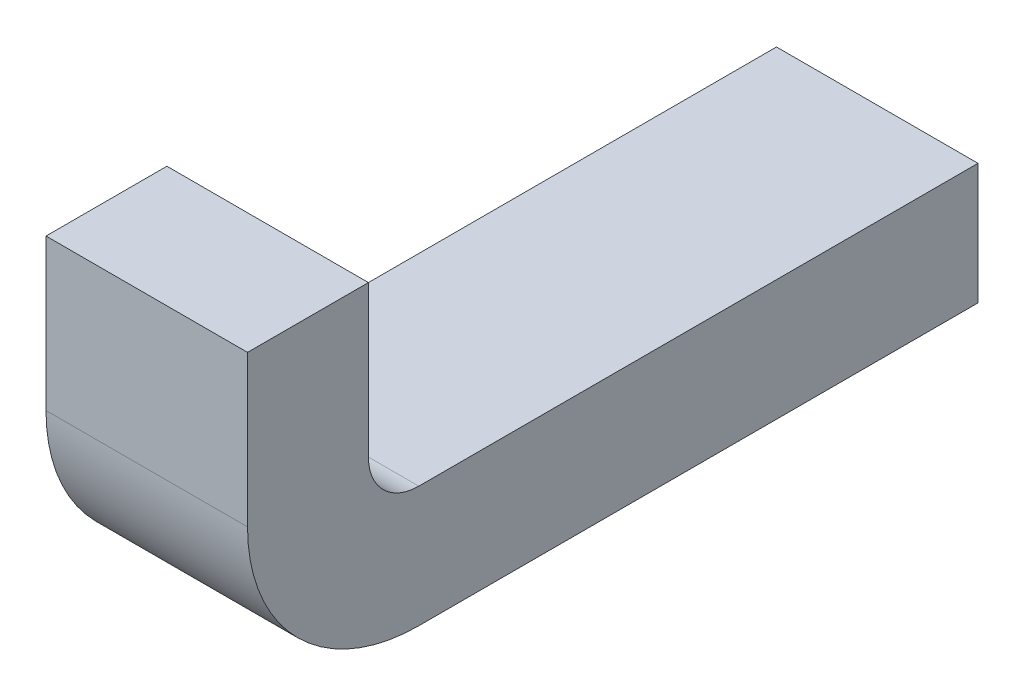
ISO-10303-21;
HEADER;
FILE_DESCRIPTION(('STEP AP214'),'2;1');
FILE_NAME('part.step','',(''),(''),'','','');
FILE_SCHEMA(('AUTOMOTIVE_DESIGN { 1 0 10303 214 1 1 1 1 }'));
ENDSEC;
DATA;
#1=APPLICATION_CONTEXT('core data for automotive mechanical design processes');
#2=APPLICATION_PROTOCOL_DEFINITION('international standard','automotive_design',2000,#1);
#3=PRODUCT_CONTEXT('',#1,'mechanical');
#4=PRODUCT('Part','Part','',(#3));
#5=PRODUCT_RELATED_PRODUCT_CATEGORY('part','',(#4));
#6=PRODUCT_DEFINITION_FORMATION('','',#4);
#7=PRODUCT_DEFINITION_CONTEXT('part definition',#1,'design');
#8=PRODUCT_DEFINITION('design','',#6,#7);
#9=PRODUCT_DEFINITION_SHAPE('','',#8);
#10=(LENGTH_UNIT() NAMED_UNIT(*) SI_UNIT(.MILLI.,.METRE.));
#11=(NAMED_UNIT(*) PLANE_ANGLE_UNIT() SI_UNIT($,.RADIAN.));
#12=(NAMED_UNIT(*) SI_UNIT($,.STERADIAN.) SOLID_ANGLE_UNIT());
#13=UNCERTAINTY_MEASURE_WITH_UNIT(LENGTH_MEASURE(1.E-05),#10,'distance_accuracy_value','');
#14=(GEOMETRIC_REPRESENTATION_CONTEXT(3) GLOBAL_UNCERTAINTY_ASSIGNED_CONTEXT((#13)) GLOBAL_UNIT_ASSIGNED_CONTEXT((#10,
#11,#12)) REPRESENTATION_CONTEXT('',''));
#15=CARTESIAN_POINT('',(0.,0.,0.));
#16=DIRECTION('',(0.,0.,1.));
#17=DIRECTION('',(1.,0.,0.));
#18=AXIS2_PLACEMENT_3D('',#15,#16,#17);
#19=CARTESIAN_POINT('',(-3.19,0.17,-3.250000000002));
#20=DIRECTION('',(0.,0.,-1.));
#21=DIRECTION('',(-1.,0.,0.));
#22=AXIS2_PLACEMENT_3D('',#19,#20,#21);
#23=PLANE('',#22);
#24=DIRECTION('',(0.,1.,0.));
#25=VECTOR('',#24,1.);
#26=CARTESIAN_POINT('',(-2.975,0.17,-3.250000000002));
#27=LINE('',#26,#25);
#28=CARTESIAN_POINT('',(-2.975,0.17,-3.250000000002));
#29=VERTEX_POINT('',#28);
#30=CARTESIAN_POINT('',(-2.975,0.32,-3.250000000002));
#31=VERTEX_POINT('',#30);
#32=EDGE_CURVE('E138',#29,#31,#27,.T.);
#33=ORIENTED_EDGE('',*,*,#32,.F.);
#34=DIRECTION('',(1.,0.,0.));
#35=VECTOR('',#34,1.);
#36=CARTESIAN_POINT('',(-3.19,0.17,-3.250000000002));
#37=LINE('',#36,#35);
#38=CARTESIAN_POINT('',(-3.175,0.17,-3.250000000002));
#39=VERTEX_POINT('',#38);
#40=EDGE_CURVE('E107',#29,#39,#37,.F.);
#41=ORIENTED_EDGE('',*,*,#40,.T.);
#42=DIRECTION('',(0.,1.,0.));
#43=VECTOR('',#42,1.);
#44=CARTESIAN_POINT('',(-3.175,0.32,-3.250000000002));
#45=LINE('',#44,#43);
#46=CARTESIAN_POINT('',(-3.175,0.32,-3.250000000002));
#47=VERTEX_POINT('',#46);
#48=EDGE_CURVE('E104',#39,#47,#45,.T.);
#49=ORIENTED_EDGE('',*,*,#48,.T.);
#50=DIRECTION('',(1.,0.,0.));
#51=VECTOR('',#50,1.);
#52=CARTESIAN_POINT('',(-3.19,0.32,-3.250000000002));
#53=LINE('',#52,#51);
#54=EDGE_CURVE('E131',#31,#47,#53,.F.);
#55=ORIENTED_EDGE('',*,*,#54,.F.);
#56=EDGE_LOOP('',(#33,#41,#49,#55));
#57=FACE_BOUND('',#56,.T.);
#58=ADVANCED_FACE('F16',(#57),#23,.T.);
#59=CARTESIAN_POINT('',(-3.19,0.32,-3.250000000002));
#60=DIRECTION('',(0.,1.,1.246832498358E-13));
#61=DIRECTION('',(0.,-1.246832498358E-13,1.));
#62=AXIS2_PLACEMENT_3D('',#59,#60,#61);
#63=PLANE('',#62);
#64=DIRECTION('',(0.,0.,-1.));
#65=VECTOR('',#64,1.);
#66=CARTESIAN_POINT('',(-2.975,0.32,-3.300000000002));
#67=LINE('',#66,#65);
#68=CARTESIAN_POINT('',(-2.975,0.32,-3.130000000002));
#69=VERTEX_POINT('',#68);
#70=EDGE_CURVE('E134',#31,#69,#67,.F.);
#71=ORIENTED_EDGE('',*,*,#70,.F.);
#72=ORIENTED_EDGE('',*,*,#54,.T.);
#73=DIRECTION('',(0.,0.,-1.));
#74=VECTOR('',#73,1.);
#75=CARTESIAN_POINT('',(-3.175,0.32,3.855));
#76=LINE('',#75,#74);
#77=CARTESIAN_POINT('',(-3.175,0.32,-3.130000000002));
#78=VERTEX_POINT('',#77);
#79=EDGE_CURVE('E98',#47,#78,#76,.F.);
#80=ORIENTED_EDGE('',*,*,#79,.T.);
#81=DIRECTION('',(1.,0.,0.));
#82=VECTOR('',#81,1.);
#83=CARTESIAN_POINT('',(-3.19,0.32,-3.130000000002));
#84=LINE('',#83,#82);
#85=EDGE_CURVE('E129',#69,#78,#84,.F.);
#86=ORIENTED_EDGE('',*,*,#85,.F.);
#87=EDGE_LOOP('',(#71,#72,#80,#86));
#88=FACE_BOUND('',#87,.T.);
#89=ADVANCED_FACE('F188',(#88),#63,.T.);
#90=CARTESIAN_POINT('',(-3.19,0.32,-3.130000000002));
#91=DIRECTION('',(0.,0.,1.));
#92=DIRECTION('',(1.,0.,0.));
#93=AXIS2_PLACEMENT_3D('',#90,#91,#92);
#94=PLANE('',#93);
#95=DIRECTION('',(0.,1.,0.));
#96=VECTOR('',#95,1.);
#97=CARTESIAN_POINT('',(-2.975,0.17,-3.130000000002));
#98=LINE('',#97,#96);
#99=CARTESIAN_POINT('',(-2.975,0.17,-3.130000000002));
#100=VERTEX_POINT('',#99);
#101=EDGE_CURVE('E137',#69,#100,#98,.F.);
#102=ORIENTED_EDGE('',*,*,#101,.F.);
#103=ORIENTED_EDGE('',*,*,#85,.T.);
#104=DIRECTION('',(0.,1.,0.));
#105=VECTOR('',#104,1.);
#106=CARTESIAN_POINT('',(-3.175,0.32,-3.130000000002));
#107=LINE('',#106,#105);
#108=CARTESIAN_POINT('',(-3.175,0.17,-3.130000000002));
#109=VERTEX_POINT('',#108);
#110=EDGE_CURVE('E78',#78,#109,#107,.F.);
#111=ORIENTED_EDGE('',*,*,#110,.T.);
#112=DIRECTION('',(1.,0.,0.));
#113=VECTOR('',#112,1.);
#114=CARTESIAN_POINT('',(-3.19,0.17,-3.130000000002));
#115=LINE('',#114,#113);
#116=EDGE_CURVE('E88',#100,#109,#115,.F.);
#117=ORIENTED_EDGE('',*,*,#116,.F.);
#118=EDGE_LOOP('',(#102,#103,#111,#117));
#119=FACE_BOUND('',#118,.T.);
#120=ADVANCED_FACE('F190',(#119),#94,.T.);
#121=CARTESIAN_POINT('',(-3.19,0.17,-3.300000000002));
#122=DIRECTION('',(1.,0.,0.));
#123=DIRECTION('',(0.,0.,-1.));
#124=AXIS2_PLACEMENT_3D('',#121,#122,#123);
#125=CYLINDRICAL_SURFACE('',#124,0.17);
#126=CARTESIAN_POINT('',(-2.975,0.17,-3.300000000002));
#127=DIRECTION('',(1.,0.,0.));
#128=DIRECTION('',(0.,0.,-1.));
#129=AXIS2_PLACEMENT_3D('',#126,#127,#128);
#130=CIRCLE('',#129,0.17);
#131=CARTESIAN_POINT('',(-2.975,0.,-3.300000000002));
#132=VERTEX_POINT('',#131);
#133=EDGE_CURVE('E149',#100,#132,#130,.T.);
#134=ORIENTED_EDGE('',*,*,#133,.F.);
#135=ORIENTED_EDGE('',*,*,#116,.T.);
#136=CARTESIAN_POINT('',(-3.175,0.17,-3.300000000002));
#137=DIRECTION('',(1.,0.,0.));
#138=DIRECTION('',(0.,0.,-1.));
#139=AXIS2_PLACEMENT_3D('',#136,#137,#138);
#140=CIRCLE('',#139,0.17);
#141=CARTESIAN_POINT('',(-3.175,0.,-3.300000000002));
#142=VERTEX_POINT('',#141);
#143=EDGE_CURVE('E19',#109,#142,#140,.T.);
#144=ORIENTED_EDGE('',*,*,#143,.T.);
#145=DIRECTION('',(1.,0.,0.));
#146=VECTOR('',#145,1.);
#147=CARTESIAN_POINT('',(-3.19,0.,-3.300000000002));
#148=LINE('',#147,#146);
#149=EDGE_CURVE('E86',#132,#142,#148,.F.);
#150=ORIENTED_EDGE('',*,*,#149,.F.);
#151=EDGE_LOOP('',(#134,#135,#144,#150));
#152=FACE_BOUND('',#151,.T.);
#153=ADVANCED_FACE('F85',(#152),#125,.T.);
#154=CARTESIAN_POINT('',(-3.19,0.,-3.300000000002));
#155=DIRECTION('',(0.,-1.,0.));
#156=DIRECTION('',(0.,0.,-1.));
#157=AXIS2_PLACEMENT_3D('',#154,#155,#156);
#158=PLANE('',#157);
#159=DIRECTION('',(0.,0.,-1.));
#160=VECTOR('',#159,1.);
#161=CARTESIAN_POINT('',(-2.975,0.,-3.300000000002));
#162=LINE('',#161,#160);
#163=CARTESIAN_POINT('',(-2.975,0.,-3.854999999999));
#164=VERTEX_POINT('',#163);
#165=EDGE_CURVE('E96',#132,#164,#162,.T.);
#166=ORIENTED_EDGE('',*,*,#165,.F.);
#167=ORIENTED_EDGE('',*,*,#149,.T.);
#168=DIRECTION('',(0.,0.,-1.));
#169=VECTOR('',#168,1.);
#170=CARTESIAN_POINT('',(-3.175,0.,3.855));
#171=LINE('',#170,#169);
#172=CARTESIAN_POINT('',(-3.175,0.,-3.854999999999));
#173=VERTEX_POINT('',#172);
#174=EDGE_CURVE('E91',#142,#173,#171,.T.);
#175=ORIENTED_EDGE('',*,*,#174,.T.);
#176=DIRECTION('',(-1.,0.,0.));
#177=VECTOR('',#176,1.);
#178=CARTESIAN_POINT('',(-3.19,0.,-3.854999999999));
#179=LINE('',#178,#177);
#180=EDGE_CURVE('E121',#164,#173,#179,.T.);
#181=ORIENTED_EDGE('',*,*,#180,.F.);
#182=EDGE_LOOP('',(#166,#167,#175,#181));
#183=FACE_BOUND('',#182,.T.);
#184=ADVANCED_FACE('F93',(#183),#158,.T.);
#185=CARTESIAN_POINT('',(-3.175,0.32,3.855));
#186=DIRECTION('',(1.,0.,0.));
#187=DIRECTION('',(0.,0.,-1.));
#188=AXIS2_PLACEMENT_3D('',#185,#186,#187);
#189=PLANE('',#188);
#190=CARTESIAN_POINT('',(-3.175,0.17,-3.300000000002));
#191=DIRECTION('',(1.,0.,0.));
#192=DIRECTION('',(0.,0.,-1.));
#193=AXIS2_PLACEMENT_3D('',#190,#191,#192);
#194=CIRCLE('',#193,0.05);
#195=CARTESIAN_POINT('',(-3.175,0.12,-3.300000000002));
#196=VERTEX_POINT('',#195);
#197=EDGE_CURVE('E126',#39,#196,#194,.T.);
#198=ORIENTED_EDGE('',*,*,#197,.T.);
#199=DIRECTION('',(0.,0.,1.));
#200=VECTOR('',#199,1.);
#201=CARTESIAN_POINT('',(-3.175,0.12,-3.854999999999));
#202=LINE('',#201,#200);
#203=CARTESIAN_POINT('',(-3.175,0.12,-3.854999999999));
#204=VERTEX_POINT('',#203);
#205=EDGE_CURVE('E123',#204,#196,#202,.T.);
#206=ORIENTED_EDGE('',*,*,#205,.F.);
#207=DIRECTION('',(0.,1.,0.));
#208=VECTOR('',#207,1.);
#209=CARTESIAN_POINT('',(-3.175,0.,-3.854999999999));
#210=LINE('',#209,#208);
#211=EDGE_CURVE('E102',#173,#204,#210,.T.);
#212=ORIENTED_EDGE('',*,*,#211,.F.);
#213=ORIENTED_EDGE('',*,*,#174,.F.);
#214=ORIENTED_EDGE('',*,*,#143,.F.);
#215=ORIENTED_EDGE('',*,*,#110,.F.);
#216=ORIENTED_EDGE('',*,*,#79,.F.);
#217=ORIENTED_EDGE('',*,*,#48,.F.);
#218=EDGE_LOOP('',(#198,#206,#212,#213,#214,#215,#216,#217));
#219=FACE_BOUND('',#218,.T.);
#220=ADVANCED_FACE('F100',(#219),#189,.F.);
#221=CARTESIAN_POINT('',(-3.19,0.17,-3.300000000002));
#222=DIRECTION('',(1.,0.,0.));
#223=DIRECTION('',(0.,0.,-1.));
#224=AXIS2_PLACEMENT_3D('',#221,#222,#223);
#225=CYLINDRICAL_SURFACE('',#224,0.05);
#226=ORIENTED_EDGE('',*,*,#40,.F.);
#227=CARTESIAN_POINT('',(-2.975,0.17,-3.300000000002));
#228=DIRECTION('',(1.,0.,0.));
#229=DIRECTION('',(0.,0.,-1.));
#230=AXIS2_PLACEMENT_3D('',#227,#228,#229);
#231=CIRCLE('',#230,0.05);
#232=CARTESIAN_POINT('',(-2.975,0.12,-3.300000000002));
#233=VERTEX_POINT('',#232);
#234=EDGE_CURVE('E118',#233,#29,#231,.F.);
#235=ORIENTED_EDGE('',*,*,#234,.F.);
#236=DIRECTION('',(1.,0.,0.));
#237=VECTOR('',#236,1.);
#238=CARTESIAN_POINT('',(-3.19,0.12,-3.300000000002));
#239=LINE('',#238,#237);
#240=EDGE_CURVE('E161',#196,#233,#239,.T.);
#241=ORIENTED_EDGE('',*,*,#240,.F.);
#242=ORIENTED_EDGE('',*,*,#197,.F.);
#243=EDGE_LOOP('',(#226,#235,#241,#242));
#244=FACE_BOUND('',#243,.T.);
#245=ADVANCED_FACE('F183',(#244),#225,.F.);
#246=CARTESIAN_POINT('',(-2.975,0.17,-3.300000000002));
#247=DIRECTION('',(1.,0.,0.));
#248=DIRECTION('',(0.,0.,-1.));
#249=AXIS2_PLACEMENT_3D('',#246,#247,#248);
#250=PLANE('',#249);
#251=DIRECTION('',(0.,0.,1.));
#252=VECTOR('',#251,1.);
#253=CARTESIAN_POINT('',(-2.975,0.12,-3.854999999999));
#254=LINE('',#253,#252);
#255=CARTESIAN_POINT('',(-2.975,0.12,-3.854999999999));
#256=VERTEX_POINT('',#255);
#257=EDGE_CURVE('E25',#233,#256,#254,.F.);
#258=ORIENTED_EDGE('',*,*,#257,.F.);
#259=ORIENTED_EDGE('',*,*,#234,.T.);
#260=ORIENTED_EDGE('',*,*,#32,.T.);
#261=ORIENTED_EDGE('',*,*,#70,.T.);
#262=ORIENTED_EDGE('',*,*,#101,.T.);
#263=ORIENTED_EDGE('',*,*,#133,.T.);
#264=ORIENTED_EDGE('',*,*,#165,.T.);
#265=DIRECTION('',(0.,1.,0.));
#266=VECTOR('',#265,1.);
#267=CARTESIAN_POINT('',(-2.975,0.,-3.854999999999));
#268=LINE('',#267,#266);
#269=EDGE_CURVE('E34',#256,#164,#268,.F.);
#270=ORIENTED_EDGE('',*,*,#269,.F.);
#271=EDGE_LOOP('',(#258,#259,#260,#261,#262,#263,#264,#270));
#272=FACE_BOUND('',#271,.T.);
#273=ADVANCED_FACE('F180',(#272),#250,.T.);
#274=CARTESIAN_POINT('',(-3.19,0.,-3.854999999999));
#275=DIRECTION('',(0.,0.,-1.));
#276=DIRECTION('',(-1.,0.,0.));
#277=AXIS2_PLACEMENT_3D('',#274,#275,#276);
#278=PLANE('',#277);
#279=ORIENTED_EDGE('',*,*,#269,.T.);
#280=ORIENTED_EDGE('',*,*,#180,.T.);
#281=ORIENTED_EDGE('',*,*,#211,.T.);
#282=DIRECTION('',(1.,0.,0.));
#283=VECTOR('',#282,1.);
#284=CARTESIAN_POINT('',(-3.19,0.12,-3.854999999999));
#285=LINE('',#284,#283);
#286=EDGE_CURVE('E11',#256,#204,#285,.F.);
#287=ORIENTED_EDGE('',*,*,#286,.F.);
#288=EDGE_LOOP('',(#279,#280,#281,#287));
#289=FACE_BOUND('',#288,.T.);
#290=ADVANCED_FACE('F179',(#289),#278,.T.);
#291=CARTESIAN_POINT('',(-3.19,0.12,-3.854999999999));
#292=DIRECTION('',(0.,1.,0.));
#293=DIRECTION('',(0.,0.,1.));
#294=AXIS2_PLACEMENT_3D('',#291,#292,#293);
#295=PLANE('',#294);
#296=ORIENTED_EDGE('',*,*,#257,.T.);
#297=ORIENTED_EDGE('',*,*,#286,.T.);
#298=ORIENTED_EDGE('',*,*,#205,.T.);
#299=ORIENTED_EDGE('',*,*,#240,.T.);
#300=EDGE_LOOP('',(#296,#297,#298,#299));
#301=FACE_BOUND('',#300,.T.);
#302=ADVANCED_FACE('F177',(#301),#295,.T.);
#303=CLOSED_SHELL('',(#58,#89,#120,#153,#184,#220,#245,#273,#290,#302));
#304=MANIFOLD_SOLID_BREP('B1',#303);
#305=ADVANCED_BREP_SHAPE_REPRESENTATION('',(#18,#304),#14);
#306=SHAPE_DEFINITION_REPRESENTATION(#9,#305);
ENDSEC;
END-ISO-10303-21;
